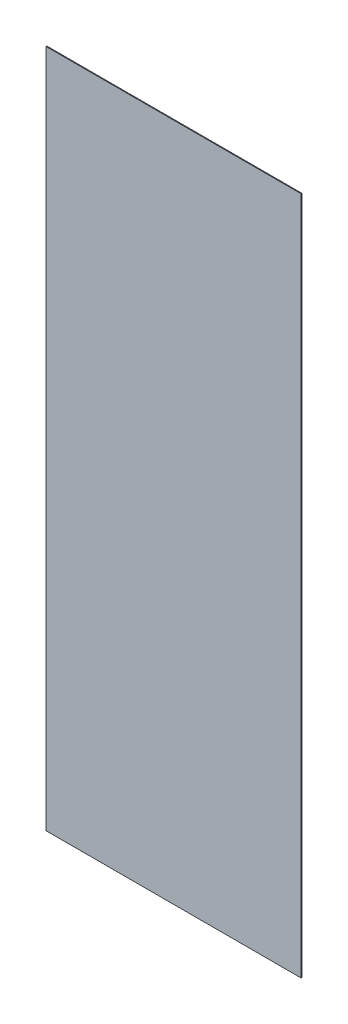
ISO-10303-21;
HEADER;
FILE_DESCRIPTION(('STEP AP214'),'2;1');
FILE_NAME('part.step','',(''),(''),'','','');
FILE_SCHEMA(('AUTOMOTIVE_DESIGN { 1 0 10303 214 1 1 1 1 }'));
ENDSEC;
DATA;
#1=APPLICATION_CONTEXT('core data for automotive mechanical design processes');
#2=APPLICATION_PROTOCOL_DEFINITION('international standard','automotive_design',2000,#1);
#3=PRODUCT_CONTEXT('',#1,'mechanical');
#4=PRODUCT('Part','Part','',(#3));
#5=PRODUCT_RELATED_PRODUCT_CATEGORY('part','',(#4));
#6=PRODUCT_DEFINITION_FORMATION('','',#4);
#7=PRODUCT_DEFINITION_CONTEXT('part definition',#1,'design');
#8=PRODUCT_DEFINITION('design','',#6,#7);
#9=PRODUCT_DEFINITION_SHAPE('','',#8);
#10=(LENGTH_UNIT() NAMED_UNIT(*) SI_UNIT(.MILLI.,.METRE.));
#11=(NAMED_UNIT(*) PLANE_ANGLE_UNIT() SI_UNIT($,.RADIAN.));
#12=(NAMED_UNIT(*) SI_UNIT($,.STERADIAN.) SOLID_ANGLE_UNIT());
#13=UNCERTAINTY_MEASURE_WITH_UNIT(LENGTH_MEASURE(1.E-05),#10,'distance_accuracy_value','');
#14=(GEOMETRIC_REPRESENTATION_CONTEXT(3) GLOBAL_UNCERTAINTY_ASSIGNED_CONTEXT((#13)) GLOBAL_UNIT_ASSIGNED_CONTEXT((#10,
#11,#12)) REPRESENTATION_CONTEXT('',''));
#15=CARTESIAN_POINT('',(0.,0.,0.));
#16=DIRECTION('',(0.,0.,1.));
#17=DIRECTION('',(1.,0.,0.));
#18=AXIS2_PLACEMENT_3D('',#15,#16,#17);
#19=CARTESIAN_POINT('',(0.,0.,1.));
#20=DIRECTION('',(1.,0.,0.));
#21=DIRECTION('',(0.,0.,-1.));
#22=AXIS2_PLACEMENT_3D('',#19,#20,#21);
#23=PLANE('',#22);
#24=DIRECTION('',(0.,-1.,0.));
#25=VECTOR('',#24,1.);
#26=CARTESIAN_POINT('',(0.,0.,0.));
#27=LINE('',#26,#25);
#28=CARTESIAN_POINT('',(0.,820.,0.));
#29=VERTEX_POINT('',#28);
#30=CARTESIAN_POINT('',(0.,0.,0.));
#31=VERTEX_POINT('',#30);
#32=EDGE_CURVE('E96',#29,#31,#27,.T.);
#33=ORIENTED_EDGE('',*,*,#32,.T.);
#34=DIRECTION('',(0.,0.,-1.));
#35=VECTOR('',#34,1.);
#36=CARTESIAN_POINT('',(0.,0.,1.));
#37=LINE('',#36,#35);
#38=CARTESIAN_POINT('',(0.,0.,1.));
#39=VERTEX_POINT('',#38);
#40=EDGE_CURVE('E11',#39,#31,#37,.T.);
#41=ORIENTED_EDGE('',*,*,#40,.F.);
#42=DIRECTION('',(0.,-1.,0.));
#43=VECTOR('',#42,1.);
#44=CARTESIAN_POINT('',(0.,0.,1.));
#45=LINE('',#44,#43);
#46=CARTESIAN_POINT('',(0.,820.,1.));
#47=VERTEX_POINT('',#46);
#48=EDGE_CURVE('E84',#47,#39,#45,.T.);
#49=ORIENTED_EDGE('',*,*,#48,.F.);
#50=DIRECTION('',(0.,0.,-1.));
#51=VECTOR('',#50,1.);
#52=CARTESIAN_POINT('',(0.,820.,1.));
#53=LINE('',#52,#51);
#54=EDGE_CURVE('E92',#47,#29,#53,.T.);
#55=ORIENTED_EDGE('',*,*,#54,.T.);
#56=EDGE_LOOP('',(#33,#41,#49,#55));
#57=FACE_BOUND('',#56,.T.);
#58=ADVANCED_FACE('F33',(#57),#23,.F.);
#59=CARTESIAN_POINT('',(0.,0.,1.));
#60=DIRECTION('',(0.,1.,0.));
#61=DIRECTION('',(0.,0.,1.));
#62=AXIS2_PLACEMENT_3D('',#59,#60,#61);
#63=PLANE('',#62);
#64=DIRECTION('',(1.,0.,0.));
#65=VECTOR('',#64,1.);
#66=CARTESIAN_POINT('',(0.,0.,0.));
#67=LINE('',#66,#65);
#68=CARTESIAN_POINT('',(308.,0.,0.));
#69=VERTEX_POINT('',#68);
#70=EDGE_CURVE('E88',#31,#69,#67,.T.);
#71=ORIENTED_EDGE('',*,*,#70,.T.);
#72=DIRECTION('',(0.,0.,-1.));
#73=VECTOR('',#72,1.);
#74=CARTESIAN_POINT('',(308.,0.,1.));
#75=LINE('',#74,#73);
#76=CARTESIAN_POINT('',(308.,0.,1.));
#77=VERTEX_POINT('',#76);
#78=EDGE_CURVE('E41',#77,#69,#75,.T.);
#79=ORIENTED_EDGE('',*,*,#78,.F.);
#80=DIRECTION('',(1.,0.,0.));
#81=VECTOR('',#80,1.);
#82=CARTESIAN_POINT('',(0.,0.,1.));
#83=LINE('',#82,#81);
#84=EDGE_CURVE('E79',#39,#77,#83,.T.);
#85=ORIENTED_EDGE('',*,*,#84,.F.);
#86=ORIENTED_EDGE('',*,*,#40,.T.);
#87=EDGE_LOOP('',(#71,#79,#85,#86));
#88=FACE_BOUND('',#87,.T.);
#89=ADVANCED_FACE('F87',(#88),#63,.F.);
#90=CARTESIAN_POINT('',(308.,0.,1.));
#91=DIRECTION('',(-1.,0.,0.));
#92=DIRECTION('',(0.,0.,1.));
#93=AXIS2_PLACEMENT_3D('',#90,#91,#92);
#94=PLANE('',#93);
#95=DIRECTION('',(0.,1.,0.));
#96=VECTOR('',#95,1.);
#97=CARTESIAN_POINT('',(308.,0.,0.));
#98=LINE('',#97,#96);
#99=CARTESIAN_POINT('',(308.,820.,0.));
#100=VERTEX_POINT('',#99);
#101=EDGE_CURVE('E66',#69,#100,#98,.T.);
#102=ORIENTED_EDGE('',*,*,#101,.T.);
#103=DIRECTION('',(0.,0.,-1.));
#104=VECTOR('',#103,1.);
#105=CARTESIAN_POINT('',(308.,820.,1.));
#106=LINE('',#105,#104);
#107=CARTESIAN_POINT('',(308.,820.,1.));
#108=VERTEX_POINT('',#107);
#109=EDGE_CURVE('E89',#108,#100,#106,.T.);
#110=ORIENTED_EDGE('',*,*,#109,.F.);
#111=DIRECTION('',(0.,1.,0.));
#112=VECTOR('',#111,1.);
#113=CARTESIAN_POINT('',(308.,0.,1.));
#114=LINE('',#113,#112);
#115=EDGE_CURVE('E82',#77,#108,#114,.T.);
#116=ORIENTED_EDGE('',*,*,#115,.F.);
#117=ORIENTED_EDGE('',*,*,#78,.T.);
#118=EDGE_LOOP('',(#102,#110,#116,#117));
#119=FACE_BOUND('',#118,.T.);
#120=ADVANCED_FACE('F90',(#119),#94,.F.);
#121=CARTESIAN_POINT('',(0.,820.,1.));
#122=DIRECTION('',(0.,-1.,0.));
#123=DIRECTION('',(0.,0.,-1.));
#124=AXIS2_PLACEMENT_3D('',#121,#122,#123);
#125=PLANE('',#124);
#126=DIRECTION('',(-1.,0.,0.));
#127=VECTOR('',#126,1.);
#128=CARTESIAN_POINT('',(0.,820.,0.));
#129=LINE('',#128,#127);
#130=EDGE_CURVE('E72',#100,#29,#129,.T.);
#131=ORIENTED_EDGE('',*,*,#130,.T.);
#132=ORIENTED_EDGE('',*,*,#54,.F.);
#133=DIRECTION('',(-1.,0.,0.));
#134=VECTOR('',#133,1.);
#135=CARTESIAN_POINT('',(0.,820.,1.));
#136=LINE('',#135,#134);
#137=EDGE_CURVE('E49',#108,#47,#136,.T.);
#138=ORIENTED_EDGE('',*,*,#137,.F.);
#139=ORIENTED_EDGE('',*,*,#109,.T.);
#140=EDGE_LOOP('',(#131,#132,#138,#139));
#141=FACE_BOUND('',#140,.T.);
#142=ADVANCED_FACE('F103',(#141),#125,.F.);
#143=CARTESIAN_POINT('',(0.,0.,1.));
#144=DIRECTION('',(0.,0.,-1.));
#145=DIRECTION('',(-1.,0.,0.));
#146=AXIS2_PLACEMENT_3D('',#143,#144,#145);
#147=PLANE('',#146);
#148=ORIENTED_EDGE('',*,*,#48,.T.);
#149=ORIENTED_EDGE('',*,*,#84,.T.);
#150=ORIENTED_EDGE('',*,*,#115,.T.);
#151=ORIENTED_EDGE('',*,*,#137,.T.);
#152=EDGE_LOOP('',(#148,#149,#150,#151));
#153=FACE_BOUND('',#152,.T.);
#154=ADVANCED_FACE('F80',(#153),#147,.F.);
#155=CARTESIAN_POINT('',(0.,0.,0.));
#156=DIRECTION('',(0.,0.,-1.));
#157=DIRECTION('',(-1.,0.,0.));
#158=AXIS2_PLACEMENT_3D('',#155,#156,#157);
#159=PLANE('',#158);
#160=ORIENTED_EDGE('',*,*,#32,.F.);
#161=ORIENTED_EDGE('',*,*,#130,.F.);
#162=ORIENTED_EDGE('',*,*,#101,.F.);
#163=ORIENTED_EDGE('',*,*,#70,.F.);
#164=EDGE_LOOP('',(#160,#161,#162,#163));
#165=FACE_BOUND('',#164,.T.);
#166=ADVANCED_FACE('F106',(#165),#159,.T.);
#167=CLOSED_SHELL('',(#58,#89,#120,#142,#154,#166));
#168=MANIFOLD_SOLID_BREP('B2',#167);
#169=ADVANCED_BREP_SHAPE_REPRESENTATION('',(#18,#168),#14);
#170=SHAPE_DEFINITION_REPRESENTATION(#9,#169);
ENDSEC;
END-ISO-10303-21;
